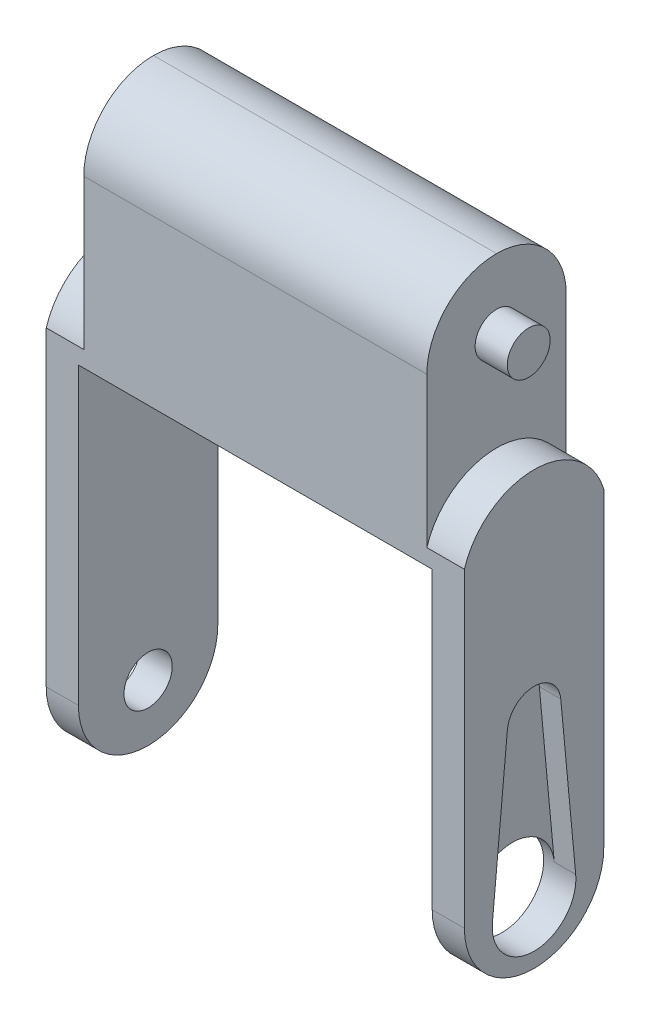
ISO-10303-21;
HEADER;
FILE_DESCRIPTION(('STEP AP214'),'2;1');
FILE_NAME('part.step','',(''),(''),'','','');
FILE_SCHEMA(('AUTOMOTIVE_DESIGN { 1 0 10303 214 1 1 1 1 }'));
ENDSEC;
DATA;
#1=APPLICATION_CONTEXT('core data for automotive mechanical design processes');
#2=APPLICATION_PROTOCOL_DEFINITION('international standard','automotive_design',2000,#1);
#3=PRODUCT_CONTEXT('',#1,'mechanical');
#4=PRODUCT('Part','Part','',(#3));
#5=PRODUCT_RELATED_PRODUCT_CATEGORY('part','',(#4));
#6=PRODUCT_DEFINITION_FORMATION('','',#4);
#7=PRODUCT_DEFINITION_CONTEXT('part definition',#1,'design');
#8=PRODUCT_DEFINITION('design','',#6,#7);
#9=PRODUCT_DEFINITION_SHAPE('','',#8);
#10=(LENGTH_UNIT() NAMED_UNIT(*) SI_UNIT(.MILLI.,.METRE.));
#11=(NAMED_UNIT(*) PLANE_ANGLE_UNIT() SI_UNIT($,.RADIAN.));
#12=(NAMED_UNIT(*) SI_UNIT($,.STERADIAN.) SOLID_ANGLE_UNIT());
#13=UNCERTAINTY_MEASURE_WITH_UNIT(LENGTH_MEASURE(1.E-05),#10,'distance_accuracy_value','');
#14=(GEOMETRIC_REPRESENTATION_CONTEXT(3) GLOBAL_UNCERTAINTY_ASSIGNED_CONTEXT((#13)) GLOBAL_UNIT_ASSIGNED_CONTEXT((#10,
#11,#12)) REPRESENTATION_CONTEXT('',''));
#15=CARTESIAN_POINT('',(0.,0.,0.));
#16=DIRECTION('',(0.,0.,1.));
#17=DIRECTION('',(1.,0.,0.));
#18=AXIS2_PLACEMENT_3D('',#15,#16,#17);
#19=CARTESIAN_POINT('',(39.,5.2939885389216,6.5));
#20=DIRECTION('',(-1.,0.,0.));
#21=DIRECTION('',(0.,0.,1.));
#22=AXIS2_PLACEMENT_3D('',#19,#20,#21);
#23=CYLINDRICAL_SURFACE('',#22,3.9);
#24=CARTESIAN_POINT('',(36.,5.2939885389216,6.5));
#25=DIRECTION('',(-1.,0.,0.));
#26=DIRECTION('',(0.,0.,1.));
#27=AXIS2_PLACEMENT_3D('',#24,#25,#26);
#28=CIRCLE('',#27,3.9);
#29=CARTESIAN_POINT('',(36.,5.2939885389216,10.4));
#30=VERTEX_POINT('',#29);
#31=EDGE_CURVE('E193',#30,#30,#28,.T.);
#32=ORIENTED_EDGE('',*,*,#31,.T.);
#33=EDGE_LOOP('',(#32));
#34=FACE_BOUND('',#33,.T.);
#35=CARTESIAN_POINT('',(37.,5.2939885389216,6.5));
#36=DIRECTION('',(1.,0.,0.));
#37=DIRECTION('',(0.,0.,-1.));
#38=AXIS2_PLACEMENT_3D('',#35,#36,#37);
#39=CIRCLE('',#38,3.9);
#40=CARTESIAN_POINT('',(37.,5.65798853892159,10.3829761781397));
#41=VERTEX_POINT('',#40);
#42=CARTESIAN_POINT('',(37.,5.65798853892159,2.61702382186035));
#43=VERTEX_POINT('',#42);
#44=EDGE_CURVE('E11',#41,#43,#39,.F.);
#45=ORIENTED_EDGE('',*,*,#44,.F.);
#46=DIRECTION('',(1.,0.,0.));
#47=VECTOR('',#46,1.);
#48=CARTESIAN_POINT('',(37.,5.65798853892159,10.3829761781397));
#49=LINE('',#48,#47);
#50=CARTESIAN_POINT('',(39.,5.65798853892159,10.3829761781397));
#51=VERTEX_POINT('',#50);
#52=EDGE_CURVE('E173',#41,#51,#49,.T.);
#53=ORIENTED_EDGE('',*,*,#52,.T.);
#54=CARTESIAN_POINT('',(39.,5.2939885389216,6.5));
#55=DIRECTION('',(-1.,0.,0.));
#56=DIRECTION('',(0.,0.,1.));
#57=AXIS2_PLACEMENT_3D('',#54,#55,#56);
#58=CIRCLE('',#57,3.9);
#59=CARTESIAN_POINT('',(39.,5.65798853892159,2.61702382186035));
#60=VERTEX_POINT('',#59);
#61=EDGE_CURVE('E197',#60,#51,#58,.T.);
#62=ORIENTED_EDGE('',*,*,#61,.F.);
#63=DIRECTION('',(1.,0.,0.));
#64=VECTOR('',#63,1.);
#65=CARTESIAN_POINT('',(37.,5.65798853892159,2.61702382186035));
#66=LINE('',#65,#64);
#67=EDGE_CURVE('E194',#43,#60,#66,.T.);
#68=ORIENTED_EDGE('',*,*,#67,.F.);
#69=EDGE_LOOP('',(#45,#53,#62,#68));
#70=FACE_BOUND('',#69,.T.);
#71=ADVANCED_FACE('F33',(#34,#70),#23,.F.);
#72=CARTESIAN_POINT('',(0.,0.,13.));
#73=DIRECTION('',(1.,0.,0.));
#74=DIRECTION('',(0.,0.,-1.));
#75=AXIS2_PLACEMENT_3D('',#72,#73,#74);
#76=PLANE('',#75);
#77=CARTESIAN_POINT('',(0.,5.29398853892159,6.5));
#78=DIRECTION('',(-1.,0.,0.));
#79=DIRECTION('',(0.,0.,1.));
#80=AXIS2_PLACEMENT_3D('',#77,#78,#79);
#81=CIRCLE('',#80,2.25);
#82=CARTESIAN_POINT('',(0.,5.29398853892159,8.75));
#83=VERTEX_POINT('',#82);
#84=EDGE_CURVE('E232',#83,#83,#81,.T.);
#85=ORIENTED_EDGE('',*,*,#84,.F.);
#86=EDGE_LOOP('',(#85));
#87=FACE_BOUND('',#86,.T.);
#88=CARTESIAN_POINT('',(0.,6.5,6.5));
#89=DIRECTION('',(1.,0.,0.));
#90=DIRECTION('',(0.,0.,-1.));
#91=AXIS2_PLACEMENT_3D('',#88,#89,#90);
#92=CIRCLE('',#91,6.5);
#93=CARTESIAN_POINT('',(0.,6.5,0.));
#94=VERTEX_POINT('',#93);
#95=CARTESIAN_POINT('',(0.,0.,6.5));
#96=VERTEX_POINT('',#95);
#97=EDGE_CURVE('E55',#94,#96,#92,.F.);
#98=ORIENTED_EDGE('',*,*,#97,.T.);
#99=CARTESIAN_POINT('',(0.,6.5,6.5));
#100=DIRECTION('',(1.,0.,0.));
#101=DIRECTION('',(0.,0.,-1.));
#102=AXIS2_PLACEMENT_3D('',#99,#100,#101);
#103=CIRCLE('',#102,6.5);
#104=CARTESIAN_POINT('',(0.,6.5,13.));
#105=VERTEX_POINT('',#104);
#106=EDGE_CURVE('E41',#96,#105,#103,.F.);
#107=ORIENTED_EDGE('',*,*,#106,.T.);
#108=DIRECTION('',(0.,-1.,0.));
#109=VECTOR('',#108,1.);
#110=CARTESIAN_POINT('',(0.,0.,13.));
#111=LINE('',#110,#109);
#112=CARTESIAN_POINT('',(0.,35.5,13.));
#113=VERTEX_POINT('',#112);
#114=EDGE_CURVE('E239',#113,#105,#111,.T.);
#115=ORIENTED_EDGE('',*,*,#114,.F.);
#116=CARTESIAN_POINT('',(0.,33.5,6.5));
#117=DIRECTION('',(1.,0.,0.));
#118=DIRECTION('',(0.,0.,-1.));
#119=AXIS2_PLACEMENT_3D('',#116,#117,#118);
#120=CIRCLE('',#119,6.80073525436772);
#121=CARTESIAN_POINT('',(0.,35.5,0.));
#122=VERTEX_POINT('',#121);
#123=EDGE_CURVE('E203',#122,#113,#120,.T.);
#124=ORIENTED_EDGE('',*,*,#123,.F.);
#125=DIRECTION('',(0.,-1.,0.));
#126=VECTOR('',#125,1.);
#127=CARTESIAN_POINT('',(0.,0.,0.));
#128=LINE('',#127,#126);
#129=EDGE_CURVE('E236',#122,#94,#128,.T.);
#130=ORIENTED_EDGE('',*,*,#129,.T.);
#131=EDGE_LOOP('',(#98,#107,#115,#124,#130));
#132=FACE_BOUND('',#131,.T.);
#133=ADVANCED_FACE('F402',(#87,#132),#76,.F.);
#134=CARTESIAN_POINT('',(39.,0.,13.));
#135=DIRECTION('',(-1.,0.,0.));
#136=DIRECTION('',(0.,0.,1.));
#137=AXIS2_PLACEMENT_3D('',#134,#135,#136);
#138=PLANE('',#137);
#139=CARTESIAN_POINT('',(39.,20.2939885389216,6.5));
#140=DIRECTION('',(1.,0.,0.));
#141=DIRECTION('',(0.,0.,-1.));
#142=AXIS2_PLACEMENT_3D('',#139,#140,#141);
#143=CIRCLE('',#142,2.5);
#144=CARTESIAN_POINT('',(39.,20.5273218722549,4.01091270632074));
#145=VERTEX_POINT('',#144);
#146=CARTESIAN_POINT('',(39.,20.5273218722549,8.98908729367927));
#147=VERTEX_POINT('',#146);
#148=EDGE_CURVE('E170',#145,#147,#143,.T.);
#149=ORIENTED_EDGE('',*,*,#148,.F.);
#150=DIRECTION('',(0.,0.995634917471705,0.0933333333333335));
#151=VECTOR('',#150,1.);
#152=CARTESIAN_POINT('',(39.,5.65798853892159,2.61702382186035));
#153=LINE('',#152,#151);
#154=EDGE_CURVE('E182',#60,#145,#153,.T.);
#155=ORIENTED_EDGE('',*,*,#154,.F.);
#156=ORIENTED_EDGE('',*,*,#61,.T.);
#157=DIRECTION('',(0.,-0.995634917471705,0.0933333333333335));
#158=VECTOR('',#157,1.);
#159=CARTESIAN_POINT('',(39.,20.5273218722549,8.98908729367927));
#160=LINE('',#159,#158);
#161=EDGE_CURVE('E185',#147,#51,#160,.T.);
#162=ORIENTED_EDGE('',*,*,#161,.F.);
#163=EDGE_LOOP('',(#149,#155,#156,#162));
#164=FACE_BOUND('',#163,.T.);
#165=DIRECTION('',(0.,1.,0.));
#166=VECTOR('',#165,1.);
#167=CARTESIAN_POINT('',(39.,0.,13.));
#168=LINE('',#167,#166);
#169=CARTESIAN_POINT('',(39.,6.5,13.));
#170=VERTEX_POINT('',#169);
#171=CARTESIAN_POINT('',(39.,35.5,13.));
#172=VERTEX_POINT('',#171);
#173=EDGE_CURVE('E250',#170,#172,#168,.T.);
#174=ORIENTED_EDGE('',*,*,#173,.F.);
#175=CARTESIAN_POINT('',(39.,6.5,6.5));
#176=DIRECTION('',(-1.,0.,0.));
#177=DIRECTION('',(0.,0.,1.));
#178=AXIS2_PLACEMENT_3D('',#175,#176,#177);
#179=CIRCLE('',#178,6.5);
#180=CARTESIAN_POINT('',(39.,0.,6.5));
#181=VERTEX_POINT('',#180);
#182=EDGE_CURVE('E307',#170,#181,#179,.F.);
#183=ORIENTED_EDGE('',*,*,#182,.T.);
#184=CARTESIAN_POINT('',(39.,6.5,6.5));
#185=DIRECTION('',(-1.,0.,0.));
#186=DIRECTION('',(0.,0.,1.));
#187=AXIS2_PLACEMENT_3D('',#184,#185,#186);
#188=CIRCLE('',#187,6.5);
#189=CARTESIAN_POINT('',(39.,6.5,0.));
#190=VERTEX_POINT('',#189);
#191=EDGE_CURVE('E305',#181,#190,#188,.F.);
#192=ORIENTED_EDGE('',*,*,#191,.T.);
#193=DIRECTION('',(0.,1.,0.));
#194=VECTOR('',#193,1.);
#195=CARTESIAN_POINT('',(39.,0.,0.));
#196=LINE('',#195,#194);
#197=CARTESIAN_POINT('',(39.,35.5,0.));
#198=VERTEX_POINT('',#197);
#199=EDGE_CURVE('E266',#190,#198,#196,.T.);
#200=ORIENTED_EDGE('',*,*,#199,.T.);
#201=CARTESIAN_POINT('',(39.,33.5,6.5));
#202=DIRECTION('',(-1.,0.,0.));
#203=DIRECTION('',(0.,0.,1.));
#204=AXIS2_PLACEMENT_3D('',#201,#202,#203);
#205=CIRCLE('',#204,6.80073525436772);
#206=EDGE_CURVE('E214',#172,#198,#205,.T.);
#207=ORIENTED_EDGE('',*,*,#206,.F.);
#208=EDGE_LOOP('',(#174,#183,#192,#200,#207));
#209=FACE_BOUND('',#208,.T.);
#210=ADVANCED_FACE('F361',(#164,#209),#138,.F.);
#211=CARTESIAN_POINT('',(3.,0.,13.));
#212=DIRECTION('',(-1.,0.,0.));
#213=DIRECTION('',(0.,0.,1.));
#214=AXIS2_PLACEMENT_3D('',#211,#212,#213);
#215=PLANE('',#214);
#216=CARTESIAN_POINT('',(3.,5.29398853892159,6.5));
#217=DIRECTION('',(-1.,0.,0.));
#218=DIRECTION('',(0.,0.,1.));
#219=AXIS2_PLACEMENT_3D('',#216,#217,#218);
#220=CIRCLE('',#219,2.25);
#221=CARTESIAN_POINT('',(3.,5.29398853892159,8.75));
#222=VERTEX_POINT('',#221);
#223=EDGE_CURVE('E233',#222,#222,#220,.T.);
#224=ORIENTED_EDGE('',*,*,#223,.T.);
#225=EDGE_LOOP('',(#224));
#226=FACE_BOUND('',#225,.T.);
#227=DIRECTION('',(0.,1.,0.));
#228=VECTOR('',#227,1.);
#229=CARTESIAN_POINT('',(3.,0.,13.));
#230=LINE('',#229,#228);
#231=CARTESIAN_POINT('',(3.,6.5,13.));
#232=VERTEX_POINT('',#231);
#233=CARTESIAN_POINT('',(3.,34.,13.));
#234=VERTEX_POINT('',#233);
#235=EDGE_CURVE('E242',#232,#234,#230,.T.);
#236=ORIENTED_EDGE('',*,*,#235,.F.);
#237=CARTESIAN_POINT('',(3.,6.5,6.5));
#238=DIRECTION('',(-1.,0.,0.));
#239=DIRECTION('',(0.,0.,1.));
#240=AXIS2_PLACEMENT_3D('',#237,#238,#239);
#241=CIRCLE('',#240,6.5);
#242=CARTESIAN_POINT('',(3.,0.,6.5));
#243=VERTEX_POINT('',#242);
#244=EDGE_CURVE('E319',#232,#243,#241,.F.);
#245=ORIENTED_EDGE('',*,*,#244,.T.);
#246=CARTESIAN_POINT('',(3.,6.5,6.5));
#247=DIRECTION('',(-1.,0.,0.));
#248=DIRECTION('',(0.,0.,1.));
#249=AXIS2_PLACEMENT_3D('',#246,#247,#248);
#250=CIRCLE('',#249,6.5);
#251=CARTESIAN_POINT('',(3.,6.5,0.));
#252=VERTEX_POINT('',#251);
#253=EDGE_CURVE('E317',#243,#252,#250,.F.);
#254=ORIENTED_EDGE('',*,*,#253,.T.);
#255=DIRECTION('',(0.,1.,0.));
#256=VECTOR('',#255,1.);
#257=CARTESIAN_POINT('',(3.,0.,0.));
#258=LINE('',#257,#256);
#259=CARTESIAN_POINT('',(3.,34.,0.));
#260=VERTEX_POINT('',#259);
#261=EDGE_CURVE('E259',#252,#260,#258,.T.);
#262=ORIENTED_EDGE('',*,*,#261,.T.);
#263=DIRECTION('',(0.,0.,-1.));
#264=VECTOR('',#263,1.);
#265=CARTESIAN_POINT('',(3.,34.,13.));
#266=LINE('',#265,#264);
#267=EDGE_CURVE('E274',#234,#260,#266,.T.);
#268=ORIENTED_EDGE('',*,*,#267,.F.);
#269=EDGE_LOOP('',(#236,#245,#254,#262,#268));
#270=FACE_BOUND('',#269,.T.);
#271=ADVANCED_FACE('F335',(#226,#270),#215,.F.);
#272=CARTESIAN_POINT('',(3.,34.,13.));
#273=DIRECTION('',(0.,1.,0.));
#274=DIRECTION('',(0.,0.,1.));
#275=AXIS2_PLACEMENT_3D('',#272,#273,#274);
#276=PLANE('',#275);
#277=DIRECTION('',(1.,0.,0.));
#278=VECTOR('',#277,1.);
#279=CARTESIAN_POINT('',(3.,34.,0.));
#280=LINE('',#279,#278);
#281=CARTESIAN_POINT('',(36.,34.,0.));
#282=VERTEX_POINT('',#281);
#283=EDGE_CURVE('E261',#260,#282,#280,.T.);
#284=ORIENTED_EDGE('',*,*,#283,.T.);
#285=DIRECTION('',(0.,0.,-1.));
#286=VECTOR('',#285,1.);
#287=CARTESIAN_POINT('',(36.,34.,13.));
#288=LINE('',#287,#286);
#289=CARTESIAN_POINT('',(36.,34.,13.));
#290=VERTEX_POINT('',#289);
#291=EDGE_CURVE('E257',#290,#282,#288,.T.);
#292=ORIENTED_EDGE('',*,*,#291,.F.);
#293=DIRECTION('',(1.,0.,0.));
#294=VECTOR('',#293,1.);
#295=CARTESIAN_POINT('',(3.,34.,13.));
#296=LINE('',#295,#294);
#297=EDGE_CURVE('E245',#234,#290,#296,.T.);
#298=ORIENTED_EDGE('',*,*,#297,.F.);
#299=ORIENTED_EDGE('',*,*,#267,.T.);
#300=EDGE_LOOP('',(#284,#292,#298,#299));
#301=FACE_BOUND('',#300,.T.);
#302=ADVANCED_FACE('F345',(#301),#276,.F.);
#303=CARTESIAN_POINT('',(36.,34.,13.));
#304=DIRECTION('',(1.,0.,0.));
#305=DIRECTION('',(0.,1.,0.));
#306=AXIS2_PLACEMENT_3D('',#303,#304,#305);
#307=PLANE('',#306);
#308=ORIENTED_EDGE('',*,*,#31,.F.);
#309=EDGE_LOOP('',(#308));
#310=FACE_BOUND('',#309,.T.);
#311=CARTESIAN_POINT('',(36.,6.5,6.5));
#312=DIRECTION('',(1.,0.,0.));
#313=DIRECTION('',(0.,1.,0.));
#314=AXIS2_PLACEMENT_3D('',#311,#312,#313);
#315=CIRCLE('',#314,6.5);
#316=CARTESIAN_POINT('',(36.,6.5,0.));
#317=VERTEX_POINT('',#316);
#318=CARTESIAN_POINT('',(36.,0.,6.5));
#319=VERTEX_POINT('',#318);
#320=EDGE_CURVE('E309',#317,#319,#315,.F.);
#321=ORIENTED_EDGE('',*,*,#320,.T.);
#322=CARTESIAN_POINT('',(36.,6.5,6.5));
#323=DIRECTION('',(1.,0.,0.));
#324=DIRECTION('',(0.,1.,0.));
#325=AXIS2_PLACEMENT_3D('',#322,#323,#324);
#326=CIRCLE('',#325,6.5);
#327=CARTESIAN_POINT('',(36.,6.5,13.));
#328=VERTEX_POINT('',#327);
#329=EDGE_CURVE('E311',#319,#328,#326,.F.);
#330=ORIENTED_EDGE('',*,*,#329,.T.);
#331=DIRECTION('',(0.,-1.,0.));
#332=VECTOR('',#331,1.);
#333=CARTESIAN_POINT('',(36.,34.,13.));
#334=LINE('',#333,#332);
#335=EDGE_CURVE('E247',#290,#328,#334,.T.);
#336=ORIENTED_EDGE('',*,*,#335,.F.);
#337=ORIENTED_EDGE('',*,*,#291,.T.);
#338=DIRECTION('',(0.,-1.,0.));
#339=VECTOR('',#338,1.);
#340=CARTESIAN_POINT('',(36.,34.,0.));
#341=LINE('',#340,#339);
#342=EDGE_CURVE('E263',#282,#317,#341,.T.);
#343=ORIENTED_EDGE('',*,*,#342,.T.);
#344=EDGE_LOOP('',(#321,#330,#336,#337,#343));
#345=FACE_BOUND('',#344,.T.);
#346=ADVANCED_FACE('F349',(#310,#345),#307,.F.);
#347=CARTESIAN_POINT('',(35.5,56.,13.));
#348=DIRECTION('',(-1.,0.,0.));
#349=DIRECTION('',(0.,-1.,0.));
#350=AXIS2_PLACEMENT_3D('',#347,#348,#349);
#351=PLANE('',#350);
#352=CARTESIAN_POINT('',(35.5,49.5,6.5));
#353=DIRECTION('',(-1.,0.,0.));
#354=DIRECTION('',(0.,-1.,0.));
#355=AXIS2_PLACEMENT_3D('',#352,#353,#354);
#356=CIRCLE('',#355,2.);
#357=CARTESIAN_POINT('',(35.5,47.5,6.5));
#358=VERTEX_POINT('',#357);
#359=EDGE_CURVE('E280',#358,#358,#356,.F.);
#360=ORIENTED_EDGE('',*,*,#359,.F.);
#361=EDGE_LOOP('',(#360));
#362=FACE_BOUND('',#361,.T.);
#363=CARTESIAN_POINT('',(35.5,49.5,6.5));
#364=DIRECTION('',(-1.,0.,0.));
#365=DIRECTION('',(0.,-1.,0.));
#366=AXIS2_PLACEMENT_3D('',#363,#364,#365);
#367=CIRCLE('',#366,6.5);
#368=CARTESIAN_POINT('',(35.5,49.5,0.));
#369=VERTEX_POINT('',#368);
#370=CARTESIAN_POINT('',(35.5,56.,6.5));
#371=VERTEX_POINT('',#370);
#372=EDGE_CURVE('E290',#369,#371,#367,.F.);
#373=ORIENTED_EDGE('',*,*,#372,.T.);
#374=CARTESIAN_POINT('',(35.5,49.5,6.5));
#375=DIRECTION('',(-1.,0.,0.));
#376=DIRECTION('',(0.,-1.,0.));
#377=AXIS2_PLACEMENT_3D('',#374,#375,#376);
#378=CIRCLE('',#377,6.5);
#379=CARTESIAN_POINT('',(35.5,49.5,13.));
#380=VERTEX_POINT('',#379);
#381=EDGE_CURVE('E292',#371,#380,#378,.F.);
#382=ORIENTED_EDGE('',*,*,#381,.T.);
#383=DIRECTION('',(0.,1.,0.));
#384=VECTOR('',#383,1.);
#385=CARTESIAN_POINT('',(35.5,56.,13.));
#386=LINE('',#385,#384);
#387=CARTESIAN_POINT('',(35.5,35.5,13.));
#388=VERTEX_POINT('',#387);
#389=EDGE_CURVE('E252',#388,#380,#386,.T.);
#390=ORIENTED_EDGE('',*,*,#389,.F.);
#391=CARTESIAN_POINT('',(35.5,33.5,6.5));
#392=DIRECTION('',(-1.,0.,0.));
#393=DIRECTION('',(0.,-1.,0.));
#394=AXIS2_PLACEMENT_3D('',#391,#392,#393);
#395=CIRCLE('',#394,6.80073525436772);
#396=CARTESIAN_POINT('',(35.5,35.5,0.));
#397=VERTEX_POINT('',#396);
#398=EDGE_CURVE('E218',#388,#397,#395,.T.);
#399=ORIENTED_EDGE('',*,*,#398,.T.);
#400=DIRECTION('',(0.,1.,0.));
#401=VECTOR('',#400,1.);
#402=CARTESIAN_POINT('',(35.5,56.,0.));
#403=LINE('',#402,#401);
#404=EDGE_CURVE('E268',#397,#369,#403,.T.);
#405=ORIENTED_EDGE('',*,*,#404,.T.);
#406=EDGE_LOOP('',(#373,#382,#390,#399,#405));
#407=FACE_BOUND('',#406,.T.);
#408=ADVANCED_FACE('F387',(#362,#407),#351,.F.);
#409=CARTESIAN_POINT('',(3.49999999999999,42.,13.));
#410=DIRECTION('',(1.,0.,0.));
#411=DIRECTION('',(0.,0.,-1.));
#412=AXIS2_PLACEMENT_3D('',#409,#410,#411);
#413=PLANE('',#412);
#414=CARTESIAN_POINT('',(3.49999999999999,49.5,6.5));
#415=DIRECTION('',(1.,0.,0.));
#416=DIRECTION('',(0.,0.,-1.));
#417=AXIS2_PLACEMENT_3D('',#414,#415,#416);
#418=CIRCLE('',#417,2.);
#419=CARTESIAN_POINT('',(3.49999999999999,49.5,4.5));
#420=VERTEX_POINT('',#419);
#421=EDGE_CURVE('E277',#420,#420,#418,.F.);
#422=ORIENTED_EDGE('',*,*,#421,.F.);
#423=EDGE_LOOP('',(#422));
#424=FACE_BOUND('',#423,.T.);
#425=DIRECTION('',(0.,-1.,0.));
#426=VECTOR('',#425,1.);
#427=CARTESIAN_POINT('',(3.49999999999999,42.,13.));
#428=LINE('',#427,#426);
#429=CARTESIAN_POINT('',(3.49999999999999,49.5,13.));
#430=VERTEX_POINT('',#429);
#431=CARTESIAN_POINT('',(3.49999999999999,35.5,13.));
#432=VERTEX_POINT('',#431);
#433=EDGE_CURVE('E255',#430,#432,#428,.T.);
#434=ORIENTED_EDGE('',*,*,#433,.F.);
#435=CARTESIAN_POINT('',(3.49999999999999,49.5,6.5));
#436=DIRECTION('',(1.,0.,0.));
#437=DIRECTION('',(0.,0.,-1.));
#438=AXIS2_PLACEMENT_3D('',#435,#436,#437);
#439=CIRCLE('',#438,6.5);
#440=CARTESIAN_POINT('',(3.49999999999999,56.,6.5));
#441=VERTEX_POINT('',#440);
#442=EDGE_CURVE('E288',#430,#441,#439,.F.);
#443=ORIENTED_EDGE('',*,*,#442,.T.);
#444=CARTESIAN_POINT('',(3.49999999999999,49.5,6.5));
#445=DIRECTION('',(1.,0.,0.));
#446=DIRECTION('',(0.,0.,-1.));
#447=AXIS2_PLACEMENT_3D('',#444,#445,#446);
#448=CIRCLE('',#447,6.5);
#449=CARTESIAN_POINT('',(3.49999999999999,49.5,0.));
#450=VERTEX_POINT('',#449);
#451=EDGE_CURVE('E286',#441,#450,#448,.F.);
#452=ORIENTED_EDGE('',*,*,#451,.T.);
#453=DIRECTION('',(0.,-1.,0.));
#454=VECTOR('',#453,1.);
#455=CARTESIAN_POINT('',(3.49999999999999,42.,0.));
#456=LINE('',#455,#454);
#457=CARTESIAN_POINT('',(3.49999999999999,35.5,0.));
#458=VERTEX_POINT('',#457);
#459=EDGE_CURVE('E243',#450,#458,#456,.T.);
#460=ORIENTED_EDGE('',*,*,#459,.T.);
#461=CARTESIAN_POINT('',(3.49999999999999,33.5,6.5));
#462=DIRECTION('',(1.,0.,0.));
#463=DIRECTION('',(0.,0.,-1.));
#464=AXIS2_PLACEMENT_3D('',#461,#462,#463);
#465=CIRCLE('',#464,6.80073525436772);
#466=EDGE_CURVE('E207',#458,#432,#465,.T.);
#467=ORIENTED_EDGE('',*,*,#466,.T.);
#468=EDGE_LOOP('',(#434,#443,#452,#460,#467));
#469=FACE_BOUND('',#468,.T.);
#470=ADVANCED_FACE('F380',(#424,#469),#413,.F.);
#471=CARTESIAN_POINT('',(0.,0.,13.));
#472=DIRECTION('',(0.,0.,-1.));
#473=DIRECTION('',(-1.,0.,0.));
#474=AXIS2_PLACEMENT_3D('',#471,#472,#473);
#475=PLANE('',#474);
#476=ORIENTED_EDGE('',*,*,#335,.T.);
#477=DIRECTION('',(1.,0.,0.));
#478=VECTOR('',#477,1.);
#479=CARTESIAN_POINT('',(0.,6.5,13.));
#480=LINE('',#479,#478);
#481=EDGE_CURVE('E302',#328,#170,#480,.T.);
#482=ORIENTED_EDGE('',*,*,#481,.T.);
#483=ORIENTED_EDGE('',*,*,#173,.T.);
#484=DIRECTION('',(1.,0.,0.));
#485=VECTOR('',#484,1.);
#486=CARTESIAN_POINT('',(19.3987578118954,35.5,13.));
#487=LINE('',#486,#485);
#488=EDGE_CURVE('E217',#388,#172,#487,.T.);
#489=ORIENTED_EDGE('',*,*,#488,.F.);
#490=ORIENTED_EDGE('',*,*,#389,.T.);
#491=DIRECTION('',(-1.,0.,0.));
#492=VECTOR('',#491,1.);
#493=CARTESIAN_POINT('',(0.,49.5,13.));
#494=LINE('',#493,#492);
#495=EDGE_CURVE('E283',#380,#430,#494,.T.);
#496=ORIENTED_EDGE('',*,*,#495,.T.);
#497=ORIENTED_EDGE('',*,*,#433,.T.);
#498=DIRECTION('',(-1.,0.,0.));
#499=VECTOR('',#498,1.);
#500=CARTESIAN_POINT('',(19.6012421881046,35.5,13.));
#501=LINE('',#500,#499);
#502=EDGE_CURVE('E210',#432,#113,#501,.T.);
#503=ORIENTED_EDGE('',*,*,#502,.T.);
#504=ORIENTED_EDGE('',*,*,#114,.T.);
#505=DIRECTION('',(1.,0.,0.));
#506=VECTOR('',#505,1.);
#507=CARTESIAN_POINT('',(0.,6.5,13.));
#508=LINE('',#507,#506);
#509=EDGE_CURVE('E296',#105,#232,#508,.T.);
#510=ORIENTED_EDGE('',*,*,#509,.T.);
#511=ORIENTED_EDGE('',*,*,#235,.T.);
#512=ORIENTED_EDGE('',*,*,#297,.T.);
#513=EDGE_LOOP('',(#476,#482,#483,#489,#490,#496,#497,#503,#504,#510,#511,#512));
#514=FACE_BOUND('',#513,.T.);
#515=ADVANCED_FACE('F354',(#514),#475,.F.);
#516=CARTESIAN_POINT('',(0.,0.,0.));
#517=DIRECTION('',(0.,0.,-1.));
#518=DIRECTION('',(-1.,0.,0.));
#519=AXIS2_PLACEMENT_3D('',#516,#517,#518);
#520=PLANE('',#519);
#521=ORIENTED_EDGE('',*,*,#199,.F.);
#522=DIRECTION('',(1.,0.,0.));
#523=VECTOR('',#522,1.);
#524=CARTESIAN_POINT('',(36.,6.5,0.));
#525=LINE('',#524,#523);
#526=EDGE_CURVE('E315',#190,#317,#525,.F.);
#527=ORIENTED_EDGE('',*,*,#526,.T.);
#528=ORIENTED_EDGE('',*,*,#342,.F.);
#529=ORIENTED_EDGE('',*,*,#283,.F.);
#530=ORIENTED_EDGE('',*,*,#261,.F.);
#531=DIRECTION('',(1.,0.,0.));
#532=VECTOR('',#531,1.);
#533=CARTESIAN_POINT('',(0.,6.5,0.));
#534=LINE('',#533,#532);
#535=EDGE_CURVE('E313',#252,#94,#534,.F.);
#536=ORIENTED_EDGE('',*,*,#535,.T.);
#537=ORIENTED_EDGE('',*,*,#129,.F.);
#538=DIRECTION('',(-1.,0.,0.));
#539=VECTOR('',#538,1.);
#540=CARTESIAN_POINT('',(19.6012421881046,35.5,0.));
#541=LINE('',#540,#539);
#542=EDGE_CURVE('E205',#458,#122,#541,.T.);
#543=ORIENTED_EDGE('',*,*,#542,.F.);
#544=ORIENTED_EDGE('',*,*,#459,.F.);
#545=DIRECTION('',(-1.,0.,0.));
#546=VECTOR('',#545,1.);
#547=CARTESIAN_POINT('',(35.5,49.5,0.));
#548=LINE('',#547,#546);
#549=EDGE_CURVE('E294',#450,#369,#548,.F.);
#550=ORIENTED_EDGE('',*,*,#549,.T.);
#551=ORIENTED_EDGE('',*,*,#404,.F.);
#552=DIRECTION('',(1.,0.,0.));
#553=VECTOR('',#552,1.);
#554=CARTESIAN_POINT('',(19.3987578118954,35.5,0.));
#555=LINE('',#554,#553);
#556=EDGE_CURVE('E221',#397,#198,#555,.T.);
#557=ORIENTED_EDGE('',*,*,#556,.T.);
#558=EDGE_LOOP('',(#521,#527,#528,#529,#530,#536,#537,#543,#544,#550,#551,#557));
#559=FACE_BOUND('',#558,.T.);
#560=ADVANCED_FACE('F340',(#559),#520,.T.);
#561=CARTESIAN_POINT('',(3.,5.29398853892159,6.5));
#562=DIRECTION('',(-1.,0.,0.));
#563=DIRECTION('',(0.,0.,1.));
#564=AXIS2_PLACEMENT_3D('',#561,#562,#563);
#565=CYLINDRICAL_SURFACE('',#564,2.25);
#566=ORIENTED_EDGE('',*,*,#223,.F.);
#567=EDGE_LOOP('',(#566));
#568=FACE_BOUND('',#567,.T.);
#569=ORIENTED_EDGE('',*,*,#84,.T.);
#570=EDGE_LOOP('',(#569));
#571=FACE_BOUND('',#570,.T.);
#572=ADVANCED_FACE('F435',(#568,#571),#565,.F.);
#573=CARTESIAN_POINT('',(0.499999999999992,49.5,6.5));
#574=DIRECTION('',(1.,0.,0.));
#575=DIRECTION('',(0.,0.,-1.));
#576=AXIS2_PLACEMENT_3D('',#573,#574,#575);
#577=CYLINDRICAL_SURFACE('',#576,2.);
#578=CARTESIAN_POINT('',(0.499999999999992,49.5,6.5));
#579=DIRECTION('',(-1.,0.,0.));
#580=DIRECTION('',(0.,0.,1.));
#581=AXIS2_PLACEMENT_3D('',#578,#579,#580);
#582=CIRCLE('',#581,2.);
#583=CARTESIAN_POINT('',(0.499999999999992,49.5,8.5));
#584=VERTEX_POINT('',#583);
#585=EDGE_CURVE('E229',#584,#584,#582,.T.);
#586=ORIENTED_EDGE('',*,*,#585,.F.);
#587=EDGE_LOOP('',(#586));
#588=FACE_BOUND('',#587,.T.);
#589=ORIENTED_EDGE('',*,*,#421,.T.);
#590=EDGE_LOOP('',(#589));
#591=FACE_BOUND('',#590,.T.);
#592=ADVANCED_FACE('F431',(#588,#591),#577,.T.);
#593=CARTESIAN_POINT('',(0.499999999999992,49.5,6.5));
#594=DIRECTION('',(-1.,0.,0.));
#595=DIRECTION('',(0.,0.,1.));
#596=AXIS2_PLACEMENT_3D('',#593,#594,#595);
#597=PLANE('',#596);
#598=ORIENTED_EDGE('',*,*,#585,.T.);
#599=EDGE_LOOP('',(#598));
#600=FACE_BOUND('',#599,.T.);
#601=ADVANCED_FACE('F427',(#600),#597,.T.);
#602=CARTESIAN_POINT('',(38.5,49.5,6.5));
#603=DIRECTION('',(-1.,0.,0.));
#604=DIRECTION('',(0.,-1.,0.));
#605=AXIS2_PLACEMENT_3D('',#602,#603,#604);
#606=CYLINDRICAL_SURFACE('',#605,2.);
#607=CARTESIAN_POINT('',(38.5,49.5,6.5));
#608=DIRECTION('',(1.,0.,0.));
#609=DIRECTION('',(0.,1.,0.));
#610=AXIS2_PLACEMENT_3D('',#607,#608,#609);
#611=CIRCLE('',#610,2.);
#612=CARTESIAN_POINT('',(38.5,51.5,6.5));
#613=VERTEX_POINT('',#612);
#614=EDGE_CURVE('E226',#613,#613,#611,.T.);
#615=ORIENTED_EDGE('',*,*,#614,.F.);
#616=EDGE_LOOP('',(#615));
#617=FACE_BOUND('',#616,.T.);
#618=ORIENTED_EDGE('',*,*,#359,.T.);
#619=EDGE_LOOP('',(#618));
#620=FACE_BOUND('',#619,.T.);
#621=ADVANCED_FACE('F423',(#617,#620),#606,.T.);
#622=CARTESIAN_POINT('',(38.5,49.5,6.5));
#623=DIRECTION('',(1.,0.,0.));
#624=DIRECTION('',(0.,1.,0.));
#625=AXIS2_PLACEMENT_3D('',#622,#623,#624);
#626=PLANE('',#625);
#627=ORIENTED_EDGE('',*,*,#614,.T.);
#628=EDGE_LOOP('',(#627));
#629=FACE_BOUND('',#628,.T.);
#630=ADVANCED_FACE('F420',(#629),#626,.T.);
#631=CARTESIAN_POINT('',(19.3987578118954,33.5,6.5));
#632=DIRECTION('',(1.,0.,0.));
#633=DIRECTION('',(0.,0.,-1.));
#634=AXIS2_PLACEMENT_3D('',#631,#632,#633);
#635=CYLINDRICAL_SURFACE('',#634,6.80073525436772);
#636=ORIENTED_EDGE('',*,*,#488,.T.);
#637=ORIENTED_EDGE('',*,*,#206,.T.);
#638=ORIENTED_EDGE('',*,*,#556,.F.);
#639=ORIENTED_EDGE('',*,*,#398,.F.);
#640=EDGE_LOOP('',(#636,#637,#638,#639));
#641=FACE_BOUND('',#640,.T.);
#642=ADVANCED_FACE('F368',(#641),#635,.T.);
#643=CARTESIAN_POINT('',(19.6012421881046,33.5,6.5));
#644=DIRECTION('',(-1.,0.,0.));
#645=DIRECTION('',(0.,0.,1.));
#646=AXIS2_PLACEMENT_3D('',#643,#644,#645);
#647=CYLINDRICAL_SURFACE('',#646,6.80073525436772);
#648=ORIENTED_EDGE('',*,*,#542,.T.);
#649=ORIENTED_EDGE('',*,*,#123,.T.);
#650=ORIENTED_EDGE('',*,*,#502,.F.);
#651=ORIENTED_EDGE('',*,*,#466,.F.);
#652=EDGE_LOOP('',(#648,#649,#650,#651));
#653=FACE_BOUND('',#652,.T.);
#654=ADVANCED_FACE('F414',(#653),#647,.T.);
#655=CARTESIAN_POINT('',(3.49999999999999,49.5,6.5));
#656=DIRECTION('',(1.,0.,0.));
#657=DIRECTION('',(0.,0.,-1.));
#658=AXIS2_PLACEMENT_3D('',#655,#656,#657);
#659=CYLINDRICAL_SURFACE('',#658,6.5);
#660=DIRECTION('',(-1.,0.,0.));
#661=VECTOR('',#660,1.);
#662=CARTESIAN_POINT('',(3.49999999999999,56.,6.5));
#663=LINE('',#662,#661);
#664=EDGE_CURVE('E206',#371,#441,#663,.T.);
#665=ORIENTED_EDGE('',*,*,#664,.F.);
#666=ORIENTED_EDGE('',*,*,#372,.F.);
#667=ORIENTED_EDGE('',*,*,#549,.F.);
#668=ORIENTED_EDGE('',*,*,#451,.F.);
#669=EDGE_LOOP('',(#665,#666,#667,#668));
#670=FACE_BOUND('',#669,.T.);
#671=ADVANCED_FACE('F384',(#670),#659,.T.);
#672=CARTESIAN_POINT('',(0.,49.5,6.5));
#673=DIRECTION('',(-1.,0.,0.));
#674=DIRECTION('',(0.,0.,1.));
#675=AXIS2_PLACEMENT_3D('',#672,#673,#674);
#676=CYLINDRICAL_SURFACE('',#675,6.5);
#677=ORIENTED_EDGE('',*,*,#381,.F.);
#678=ORIENTED_EDGE('',*,*,#664,.T.);
#679=ORIENTED_EDGE('',*,*,#442,.F.);
#680=ORIENTED_EDGE('',*,*,#495,.F.);
#681=EDGE_LOOP('',(#677,#678,#679,#680));
#682=FACE_BOUND('',#681,.T.);
#683=ADVANCED_FACE('F376',(#682),#676,.T.);
#684=CARTESIAN_POINT('',(36.,6.5,6.5));
#685=DIRECTION('',(-1.,0.,0.));
#686=DIRECTION('',(0.,0.,1.));
#687=AXIS2_PLACEMENT_3D('',#684,#685,#686);
#688=CYLINDRICAL_SURFACE('',#687,6.5);
#689=DIRECTION('',(1.,0.,0.));
#690=VECTOR('',#689,1.);
#691=CARTESIAN_POINT('',(39.,0.,6.5));
#692=LINE('',#691,#690);
#693=EDGE_CURVE('E299',#319,#181,#692,.T.);
#694=ORIENTED_EDGE('',*,*,#693,.F.);
#695=ORIENTED_EDGE('',*,*,#320,.F.);
#696=ORIENTED_EDGE('',*,*,#526,.F.);
#697=ORIENTED_EDGE('',*,*,#191,.F.);
#698=EDGE_LOOP('',(#694,#695,#696,#697));
#699=FACE_BOUND('',#698,.T.);
#700=ADVANCED_FACE('F365',(#699),#688,.T.);
#701=CARTESIAN_POINT('',(0.,6.5,6.5));
#702=DIRECTION('',(1.,0.,0.));
#703=DIRECTION('',(0.,0.,-1.));
#704=AXIS2_PLACEMENT_3D('',#701,#702,#703);
#705=CYLINDRICAL_SURFACE('',#704,6.5);
#706=ORIENTED_EDGE('',*,*,#329,.F.);
#707=ORIENTED_EDGE('',*,*,#693,.T.);
#708=ORIENTED_EDGE('',*,*,#182,.F.);
#709=ORIENTED_EDGE('',*,*,#481,.F.);
#710=EDGE_LOOP('',(#706,#707,#708,#709));
#711=FACE_BOUND('',#710,.T.);
#712=ADVANCED_FACE('F357',(#711),#705,.T.);
#713=CARTESIAN_POINT('',(0.,6.5,6.5));
#714=DIRECTION('',(-1.,0.,0.));
#715=DIRECTION('',(0.,0.,1.));
#716=AXIS2_PLACEMENT_3D('',#713,#714,#715);
#717=CYLINDRICAL_SURFACE('',#716,6.5);
#718=DIRECTION('',(1.,0.,0.));
#719=VECTOR('',#718,1.);
#720=CARTESIAN_POINT('',(3.,0.,6.5));
#721=LINE('',#720,#719);
#722=EDGE_CURVE('E200',#96,#243,#721,.T.);
#723=ORIENTED_EDGE('',*,*,#722,.F.);
#724=ORIENTED_EDGE('',*,*,#97,.F.);
#725=ORIENTED_EDGE('',*,*,#535,.F.);
#726=ORIENTED_EDGE('',*,*,#253,.F.);
#727=EDGE_LOOP('',(#723,#724,#725,#726));
#728=FACE_BOUND('',#727,.T.);
#729=ADVANCED_FACE('F35',(#728),#717,.T.);
#730=CARTESIAN_POINT('',(0.,6.5,6.5));
#731=DIRECTION('',(1.,0.,0.));
#732=DIRECTION('',(0.,0.,-1.));
#733=AXIS2_PLACEMENT_3D('',#730,#731,#732);
#734=CYLINDRICAL_SURFACE('',#733,6.5);
#735=ORIENTED_EDGE('',*,*,#106,.F.);
#736=ORIENTED_EDGE('',*,*,#722,.T.);
#737=ORIENTED_EDGE('',*,*,#244,.F.);
#738=ORIENTED_EDGE('',*,*,#509,.F.);
#739=EDGE_LOOP('',(#735,#736,#737,#738));
#740=FACE_BOUND('',#739,.T.);
#741=ADVANCED_FACE('F327',(#740),#734,.T.);
#742=CARTESIAN_POINT('',(37.,20.2939885389216,6.5));
#743=DIRECTION('',(1.,0.,0.));
#744=DIRECTION('',(0.,0.,-1.));
#745=AXIS2_PLACEMENT_3D('',#742,#743,#744);
#746=PLANE('',#745);
#747=ORIENTED_EDGE('',*,*,#44,.T.);
#748=DIRECTION('',(0.,0.995634917471705,0.0933333333333335));
#749=VECTOR('',#748,1.);
#750=CARTESIAN_POINT('',(37.,5.65798853892159,2.61702382186035));
#751=LINE('',#750,#749);
#752=CARTESIAN_POINT('',(37.,20.5273218722549,4.01091270632074));
#753=VERTEX_POINT('',#752);
#754=EDGE_CURVE('E174',#43,#753,#751,.T.);
#755=ORIENTED_EDGE('',*,*,#754,.T.);
#756=CARTESIAN_POINT('',(37.,20.2939885389216,6.5));
#757=DIRECTION('',(1.,0.,0.));
#758=DIRECTION('',(0.,0.,-1.));
#759=AXIS2_PLACEMENT_3D('',#756,#757,#758);
#760=CIRCLE('',#759,2.5);
#761=CARTESIAN_POINT('',(37.,20.5273218722549,8.98908729367927));
#762=VERTEX_POINT('',#761);
#763=EDGE_CURVE('E167',#753,#762,#760,.T.);
#764=ORIENTED_EDGE('',*,*,#763,.T.);
#765=DIRECTION('',(0.,-0.995634917471705,0.0933333333333335));
#766=VECTOR('',#765,1.);
#767=CARTESIAN_POINT('',(37.,20.5273218722549,8.98908729367927));
#768=LINE('',#767,#766);
#769=EDGE_CURVE('E47',#762,#41,#768,.T.);
#770=ORIENTED_EDGE('',*,*,#769,.T.);
#771=EDGE_LOOP('',(#747,#755,#764,#770));
#772=FACE_BOUND('',#771,.T.);
#773=ADVANCED_FACE('F180',(#772),#746,.T.);
#774=CARTESIAN_POINT('',(37.,20.2939885389216,6.5));
#775=DIRECTION('',(1.,0.,0.));
#776=DIRECTION('',(0.,0.,-1.));
#777=AXIS2_PLACEMENT_3D('',#774,#775,#776);
#778=CYLINDRICAL_SURFACE('',#777,2.5);
#779=ORIENTED_EDGE('',*,*,#148,.T.);
#780=DIRECTION('',(1.,0.,0.));
#781=VECTOR('',#780,1.);
#782=CARTESIAN_POINT('',(37.,20.5273218722549,8.98908729367927));
#783=LINE('',#782,#781);
#784=EDGE_CURVE('E165',#762,#147,#783,.T.);
#785=ORIENTED_EDGE('',*,*,#784,.F.);
#786=ORIENTED_EDGE('',*,*,#763,.F.);
#787=DIRECTION('',(1.,0.,0.));
#788=VECTOR('',#787,1.);
#789=CARTESIAN_POINT('',(37.,20.5273218722549,4.01091270632074));
#790=LINE('',#789,#788);
#791=EDGE_CURVE('E191',#753,#145,#790,.T.);
#792=ORIENTED_EDGE('',*,*,#791,.T.);
#793=EDGE_LOOP('',(#779,#785,#786,#792));
#794=FACE_BOUND('',#793,.T.);
#795=ADVANCED_FACE('F166',(#794),#778,.F.);
#796=CARTESIAN_POINT('',(37.,5.65798853892159,2.61702382186035));
#797=DIRECTION('',(0.,0.0933333333333335,-0.995634917471705));
#798=DIRECTION('',(0.,0.995634917471705,0.0933333333333335));
#799=AXIS2_PLACEMENT_3D('',#796,#797,#798);
#800=PLANE('',#799);
#801=ORIENTED_EDGE('',*,*,#154,.T.);
#802=ORIENTED_EDGE('',*,*,#791,.F.);
#803=ORIENTED_EDGE('',*,*,#754,.F.);
#804=ORIENTED_EDGE('',*,*,#67,.T.);
#805=EDGE_LOOP('',(#801,#802,#803,#804));
#806=FACE_BOUND('',#805,.T.);
#807=ADVANCED_FACE('F526',(#806),#800,.F.);
#808=CARTESIAN_POINT('',(37.,20.5273218722549,8.98908729367927));
#809=DIRECTION('',(0.,0.0933333333333335,0.995634917471705));
#810=DIRECTION('',(0.,-0.995634917471705,0.0933333333333335));
#811=AXIS2_PLACEMENT_3D('',#808,#809,#810);
#812=PLANE('',#811);
#813=ORIENTED_EDGE('',*,*,#161,.T.);
#814=ORIENTED_EDGE('',*,*,#52,.F.);
#815=ORIENTED_EDGE('',*,*,#769,.F.);
#816=ORIENTED_EDGE('',*,*,#784,.T.);
#817=EDGE_LOOP('',(#813,#814,#815,#816));
#818=FACE_BOUND('',#817,.T.);
#819=ADVANCED_FACE('F176',(#818),#812,.F.);
#820=CLOSED_SHELL('',(#71,#133,#210,#271,#302,#346,#408,#470,#515,#560,#572,#592,#601,#621,#630,
#642,#654,#671,#683,#700,#712,#729,#741,#773,#795,#807,#819));
#821=MANIFOLD_SOLID_BREP('B2',#820);
#822=ADVANCED_BREP_SHAPE_REPRESENTATION('',(#18,#821),#14);
#823=SHAPE_DEFINITION_REPRESENTATION(#9,#822);
ENDSEC;
END-ISO-10303-21;
